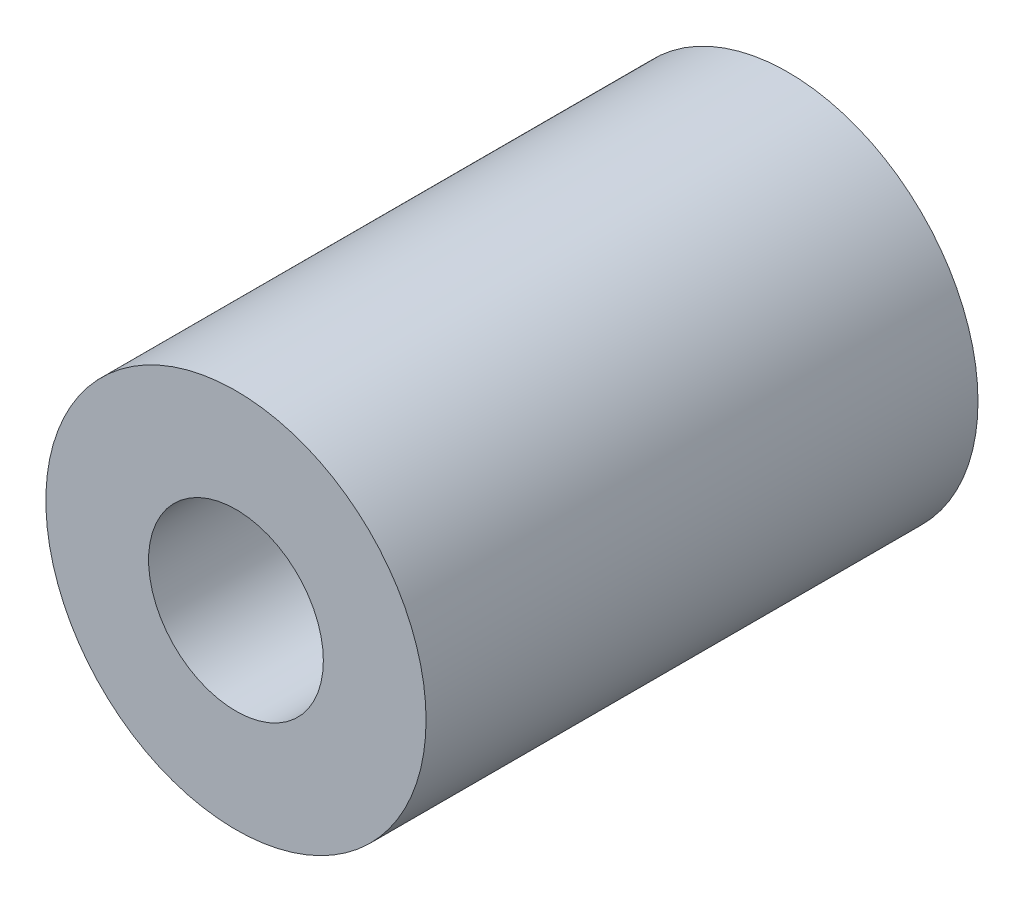
ISO-10303-21;
HEADER;
FILE_DESCRIPTION(('STEP AP214'),'2;1');
FILE_NAME('part.step','',(''),(''),'','','');
FILE_SCHEMA(('AUTOMOTIVE_DESIGN { 1 0 10303 214 1 1 1 1 }'));
ENDSEC;
DATA;
#1=APPLICATION_CONTEXT('core data for automotive mechanical design processes');
#2=APPLICATION_PROTOCOL_DEFINITION('international standard','automotive_design',2000,#1);
#3=PRODUCT_CONTEXT('',#1,'mechanical');
#4=PRODUCT('Part','Part','',(#3));
#5=PRODUCT_RELATED_PRODUCT_CATEGORY('part','',(#4));
#6=PRODUCT_DEFINITION_FORMATION('','',#4);
#7=PRODUCT_DEFINITION_CONTEXT('part definition',#1,'design');
#8=PRODUCT_DEFINITION('design','',#6,#7);
#9=PRODUCT_DEFINITION_SHAPE('','',#8);
#10=(LENGTH_UNIT() NAMED_UNIT(*) SI_UNIT(.MILLI.,.METRE.));
#11=(NAMED_UNIT(*) PLANE_ANGLE_UNIT() SI_UNIT($,.RADIAN.));
#12=(NAMED_UNIT(*) SI_UNIT($,.STERADIAN.) SOLID_ANGLE_UNIT());
#13=UNCERTAINTY_MEASURE_WITH_UNIT(LENGTH_MEASURE(1.E-05),#10,'distance_accuracy_value','');
#14=(GEOMETRIC_REPRESENTATION_CONTEXT(3) GLOBAL_UNCERTAINTY_ASSIGNED_CONTEXT((#13)) GLOBAL_UNIT_ASSIGNED_CONTEXT((#10,
#11,#12)) REPRESENTATION_CONTEXT('',''));
#15=CARTESIAN_POINT('',(0.,0.,0.));
#16=DIRECTION('',(0.,0.,1.));
#17=DIRECTION('',(1.,0.,0.));
#18=AXIS2_PLACEMENT_3D('',#15,#16,#17);
#19=CARTESIAN_POINT('',(0.,0.,9.));
#20=DIRECTION('',(0.,0.,1.));
#21=DIRECTION('',(1.,0.,0.));
#22=AXIS2_PLACEMENT_3D('',#19,#20,#21);
#23=PLANE('',#22);
#24=CARTESIAN_POINT('',(0.,0.,9.));
#25=DIRECTION('',(0.,0.,1.));
#26=DIRECTION('',(1.,0.,0.));
#27=AXIS2_PLACEMENT_3D('',#24,#25,#26);
#28=CIRCLE('',#27,3.1);
#29=CARTESIAN_POINT('',(3.1,0.,9.));
#30=VERTEX_POINT('',#29);
#31=EDGE_CURVE('E10',#30,#30,#28,.T.);
#32=ORIENTED_EDGE('',*,*,#31,.T.);
#33=EDGE_LOOP('',(#32));
#34=FACE_BOUND('',#33,.T.);
#35=CARTESIAN_POINT('',(0.,0.,9.));
#36=DIRECTION('',(0.,0.,1.));
#37=DIRECTION('',(1.,0.,0.));
#38=AXIS2_PLACEMENT_3D('',#35,#36,#37);
#39=CIRCLE('',#38,1.425);
#40=CARTESIAN_POINT('',(1.425,0.,9.));
#41=VERTEX_POINT('',#40);
#42=EDGE_CURVE('E43',#41,#41,#39,.T.);
#43=ORIENTED_EDGE('',*,*,#42,.F.);
#44=EDGE_LOOP('',(#43));
#45=FACE_BOUND('',#44,.T.);
#46=ADVANCED_FACE('F32',(#34,#45),#23,.T.);
#47=CARTESIAN_POINT('',(0.,0.,0.));
#48=DIRECTION('',(0.,0.,1.));
#49=DIRECTION('',(1.,0.,0.));
#50=AXIS2_PLACEMENT_3D('',#47,#48,#49);
#51=PLANE('',#50);
#52=CARTESIAN_POINT('',(0.,0.,0.));
#53=DIRECTION('',(0.,0.,1.));
#54=DIRECTION('',(1.,0.,0.));
#55=AXIS2_PLACEMENT_3D('',#52,#53,#54);
#56=CIRCLE('',#55,3.1);
#57=CARTESIAN_POINT('',(3.1,0.,0.));
#58=VERTEX_POINT('',#57);
#59=EDGE_CURVE('E36',#58,#58,#56,.T.);
#60=ORIENTED_EDGE('',*,*,#59,.F.);
#61=EDGE_LOOP('',(#60));
#62=FACE_BOUND('',#61,.T.);
#63=CARTESIAN_POINT('',(0.,0.,0.));
#64=DIRECTION('',(0.,0.,1.));
#65=DIRECTION('',(1.,0.,0.));
#66=AXIS2_PLACEMENT_3D('',#63,#64,#65);
#67=CIRCLE('',#66,1.425);
#68=CARTESIAN_POINT('',(1.425,0.,0.));
#69=VERTEX_POINT('',#68);
#70=EDGE_CURVE('E45',#69,#69,#67,.T.);
#71=ORIENTED_EDGE('',*,*,#70,.T.);
#72=EDGE_LOOP('',(#71));
#73=FACE_BOUND('',#72,.T.);
#74=ADVANCED_FACE('F55',(#62,#73),#51,.F.);
#75=CARTESIAN_POINT('',(0.,0.,9.));
#76=DIRECTION('',(0.,0.,-1.));
#77=DIRECTION('',(-1.,0.,0.));
#78=AXIS2_PLACEMENT_3D('',#75,#76,#77);
#79=CYLINDRICAL_SURFACE('',#78,3.1);
#80=ORIENTED_EDGE('',*,*,#31,.F.);
#81=EDGE_LOOP('',(#80));
#82=FACE_BOUND('',#81,.T.);
#83=ORIENTED_EDGE('',*,*,#59,.T.);
#84=EDGE_LOOP('',(#83));
#85=FACE_BOUND('',#84,.T.);
#86=ADVANCED_FACE('F34',(#82,#85),#79,.T.);
#87=CARTESIAN_POINT('',(0.,0.,9.));
#88=DIRECTION('',(0.,0.,-1.));
#89=DIRECTION('',(-1.,0.,0.));
#90=AXIS2_PLACEMENT_3D('',#87,#88,#89);
#91=CYLINDRICAL_SURFACE('',#90,1.425);
#92=ORIENTED_EDGE('',*,*,#42,.T.);
#93=EDGE_LOOP('',(#92));
#94=FACE_BOUND('',#93,.T.);
#95=ORIENTED_EDGE('',*,*,#70,.F.);
#96=EDGE_LOOP('',(#95));
#97=FACE_BOUND('',#96,.T.);
#98=ADVANCED_FACE('F51',(#94,#97),#91,.F.);
#99=CLOSED_SHELL('',(#46,#74,#86,#98));
#100=MANIFOLD_SOLID_BREP('B2',#99);
#101=ADVANCED_BREP_SHAPE_REPRESENTATION('',(#18,#100),#14);
#102=SHAPE_DEFINITION_REPRESENTATION(#9,#101);
ENDSEC;
END-ISO-10303-21;
